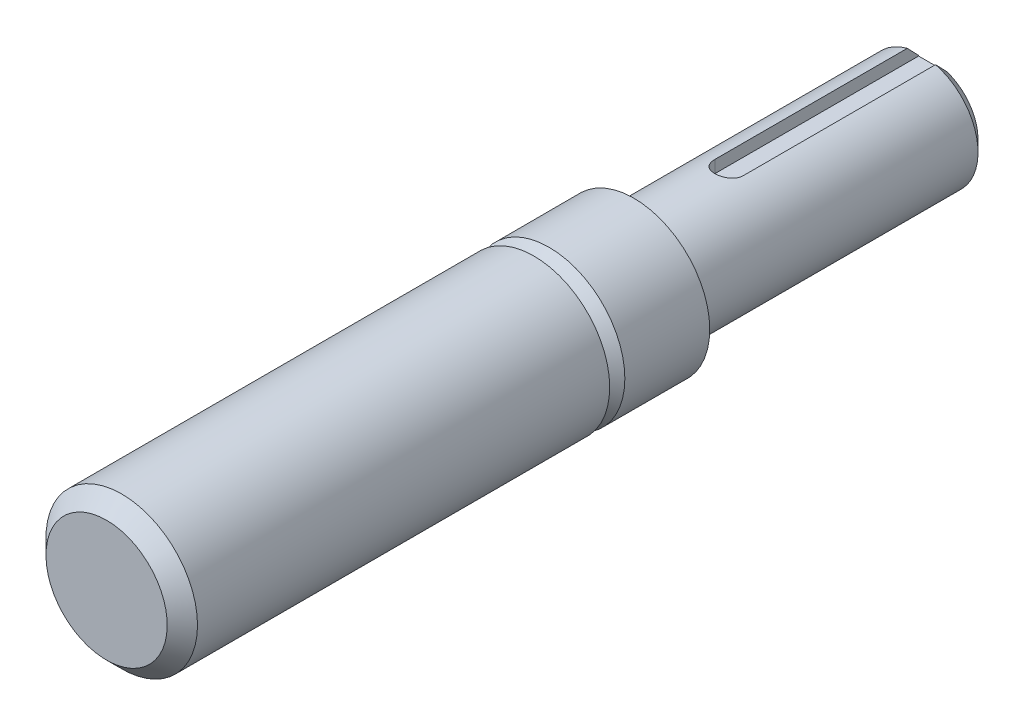
ISO-10303-21;
HEADER;
FILE_DESCRIPTION(('STEP AP214'),'2;1');
FILE_NAME('part.step','',(''),(''),'','','');
FILE_SCHEMA(('AUTOMOTIVE_DESIGN { 1 0 10303 214 1 1 1 1 }'));
ENDSEC;
DATA;
#1=APPLICATION_CONTEXT('core data for automotive mechanical design processes');
#2=APPLICATION_PROTOCOL_DEFINITION('international standard','automotive_design',2000,#1);
#3=PRODUCT_CONTEXT('',#1,'mechanical');
#4=PRODUCT('Part','Part','',(#3));
#5=PRODUCT_RELATED_PRODUCT_CATEGORY('part','',(#4));
#6=PRODUCT_DEFINITION_FORMATION('','',#4);
#7=PRODUCT_DEFINITION_CONTEXT('part definition',#1,'design');
#8=PRODUCT_DEFINITION('design','',#6,#7);
#9=PRODUCT_DEFINITION_SHAPE('','',#8);
#10=(LENGTH_UNIT() NAMED_UNIT(*) SI_UNIT(.MILLI.,.METRE.));
#11=(NAMED_UNIT(*) PLANE_ANGLE_UNIT() SI_UNIT($,.RADIAN.));
#12=(NAMED_UNIT(*) SI_UNIT($,.STERADIAN.) SOLID_ANGLE_UNIT());
#13=UNCERTAINTY_MEASURE_WITH_UNIT(LENGTH_MEASURE(1.E-05),#10,'distance_accuracy_value','');
#14=(GEOMETRIC_REPRESENTATION_CONTEXT(3) GLOBAL_UNCERTAINTY_ASSIGNED_CONTEXT((#13)) GLOBAL_UNIT_ASSIGNED_CONTEXT((#10,
#11,#12)) REPRESENTATION_CONTEXT('',''));
#15=CARTESIAN_POINT('',(0.,0.,0.));
#16=DIRECTION('',(0.,0.,1.));
#17=DIRECTION('',(1.,0.,0.));
#18=AXIS2_PLACEMENT_3D('',#15,#16,#17);
#19=CARTESIAN_POINT('',(0.,4.7625,-69.85));
#20=DIRECTION('',(0.,1.,0.));
#21=DIRECTION('',(0.,0.,1.));
#22=AXIS2_PLACEMENT_3D('',#19,#20,#21);
#23=PLANE('',#22);
#24=CARTESIAN_POINT('',(0.,4.7625,-69.85));
#25=DIRECTION('',(0.,1.,0.));
#26=DIRECTION('',(0.,0.,1.));
#27=AXIS2_PLACEMENT_3D('',#24,#25,#26);
#28=CIRCLE('',#27,1.58750000000001);
#29=CARTESIAN_POINT('',(-1.58750000000001,4.7625,-69.85));
#30=VERTEX_POINT('',#29);
#31=CARTESIAN_POINT('',(1.58750000000001,4.7625,-69.85));
#32=VERTEX_POINT('',#31);
#33=EDGE_CURVE('E74',#30,#32,#28,.T.);
#34=ORIENTED_EDGE('',*,*,#33,.T.);
#35=DIRECTION('',(0.,0.,-1.));
#36=VECTOR('',#35,1.);
#37=CARTESIAN_POINT('',(1.58750000000001,4.7625,-69.85));
#38=LINE('',#37,#36);
#39=CARTESIAN_POINT('',(1.5875,4.7625,-92.71));
#40=VERTEX_POINT('',#39);
#41=EDGE_CURVE('E70',#32,#40,#38,.T.);
#42=ORIENTED_EDGE('',*,*,#41,.T.);
#43=DIRECTION('',(1.,0.,0.));
#44=VECTOR('',#43,1.);
#45=CARTESIAN_POINT('',(0.,4.7625,-92.71));
#46=LINE('',#45,#44);
#47=CARTESIAN_POINT('',(-1.5875,4.7625,-92.71));
#48=VERTEX_POINT('',#47);
#49=EDGE_CURVE('E72',#40,#48,#46,.F.);
#50=ORIENTED_EDGE('',*,*,#49,.T.);
#51=DIRECTION('',(0.,0.,1.));
#52=VECTOR('',#51,1.);
#53=CARTESIAN_POINT('',(-1.5875,4.7625,-92.71));
#54=LINE('',#53,#52);
#55=EDGE_CURVE('E97',#48,#30,#54,.T.);
#56=ORIENTED_EDGE('',*,*,#55,.T.);
#57=EDGE_LOOP('',(#34,#42,#50,#56));
#58=FACE_BOUND('',#57,.T.);
#59=ADVANCED_FACE('F16',(#58),#23,.T.);
#60=CARTESIAN_POINT('',(0.,5.08,-92.71));
#61=DIRECTION('',(0.,0.,1.));
#62=DIRECTION('',(1.,0.,0.));
#63=AXIS2_PLACEMENT_3D('',#60,#61,#62);
#64=PLANE('',#63);
#65=DIRECTION('',(0.,1.,0.));
#66=VECTOR('',#65,1.);
#67=CARTESIAN_POINT('',(1.5875,4.7625,-92.71));
#68=LINE('',#67,#66);
#69=CARTESIAN_POINT('',(1.5875,4.82558221875647,-92.7099999999771));
#70=VERTEX_POINT('',#69);
#71=EDGE_CURVE('E79',#40,#70,#68,.T.);
#72=ORIENTED_EDGE('',*,*,#71,.T.);
#73=CARTESIAN_POINT('',(0.,0.,-92.7099999999541));
#74=DIRECTION('',(0.,0.,1.));
#75=DIRECTION('',(1.,0.,0.));
#76=AXIS2_PLACEMENT_3D('',#73,#74,#75);
#77=CIRCLE('',#76,5.08000000002085);
#78=CARTESIAN_POINT('',(-1.5875,4.82558221876673,-92.7099999999673));
#79=VERTEX_POINT('',#78);
#80=EDGE_CURVE('E64',#79,#70,#77,.T.);
#81=ORIENTED_EDGE('',*,*,#80,.F.);
#82=DIRECTION('',(0.,1.,0.));
#83=VECTOR('',#82,1.);
#84=CARTESIAN_POINT('',(-1.5875,4.7625,-92.71));
#85=LINE('',#84,#83);
#86=EDGE_CURVE('E85',#79,#48,#85,.F.);
#87=ORIENTED_EDGE('',*,*,#86,.T.);
#88=ORIENTED_EDGE('',*,*,#49,.F.);
#89=EDGE_LOOP('',(#72,#81,#87,#88));
#90=FACE_BOUND('',#89,.T.);
#91=ADVANCED_FACE('F82',(#90),#64,.F.);
#92=CARTESIAN_POINT('',(1.58750000000001,4.7625,-69.85));
#93=DIRECTION('',(1.,0.,0.));
#94=DIRECTION('',(0.,0.,-1.));
#95=AXIS2_PLACEMENT_3D('',#92,#93,#94);
#96=PLANE('',#95);
#97=ORIENTED_EDGE('',*,*,#71,.F.);
#98=ORIENTED_EDGE('',*,*,#41,.F.);
#99=DIRECTION('',(0.,1.,0.));
#100=VECTOR('',#99,1.);
#101=CARTESIAN_POINT('',(1.58750000000001,4.7625,-69.85));
#102=LINE('',#101,#100);
#103=CARTESIAN_POINT('',(1.58750000000001,6.14836106210427,-69.85));
#104=VERTEX_POINT('',#103);
#105=EDGE_CURVE('E91',#32,#104,#102,.T.);
#106=ORIENTED_EDGE('',*,*,#105,.T.);
#107=DIRECTION('',(0.,0.,1.));
#108=VECTOR('',#107,1.);
#109=CARTESIAN_POINT('',(1.5875,6.14836106210427,0.));
#110=LINE('',#109,#108);
#111=CARTESIAN_POINT('',(1.5875,6.14836106211221,-91.4400000000082));
#112=VERTEX_POINT('',#111);
#113=EDGE_CURVE('E130',#112,#104,#110,.T.);
#114=ORIENTED_EDGE('',*,*,#113,.F.);
#115=CARTESIAN_POINT('',(1.5875,4.82558221875283,-92.7099999999805));
#116=CARTESIAN_POINT('',(1.5875,4.93637443412473,-92.6047518791332));
#117=CARTESIAN_POINT('',(1.5875,5.04699444665306,-92.4993228179712));
#118=CARTESIAN_POINT('',(1.5875,5.26793948135338,-92.2881572289264));
#119=CARTESIAN_POINT('',(1.5875,5.37826450516857,-92.1824207027631));
#120=CARTESIAN_POINT('',(1.5875,5.59867002482966,-91.9706936027133));
#121=CARTESIAN_POINT('',(1.5875,5.70875052109395,-91.864703029262));
#122=CARTESIAN_POINT('',(1.5875,5.92870326414257,-91.6525047731704));
#123=CARTESIAN_POINT('',(1.5875,6.03857550976436,-91.5462970893249));
#124=CARTESIAN_POINT('',(1.5875,6.14836106212015,-91.4400000000164));
#125=B_SPLINE_CURVE_WITH_KNOTS('',3,(#115,#116,#117,#118,#119,#120,#121,#122,#123,#124),
.UNSPECIFIED.,.F.,.F.,(4,2,2,2,4),(0.,0.458441106288984,0.916879653578,1.37531741587532,
1.83375772987097),.UNSPECIFIED.);
#126=EDGE_CURVE('E19',#70,#112,#125,.T.);
#127=ORIENTED_EDGE('',*,*,#126,.F.);
#128=EDGE_LOOP('',(#97,#98,#106,#114,#127));
#129=FACE_BOUND('',#128,.T.);
#130=ADVANCED_FACE('F88',(#129),#96,.F.);
#131=CARTESIAN_POINT('',(0.,4.7625,-69.85));
#132=DIRECTION('',(0.,1.,0.));
#133=DIRECTION('',(0.,0.,1.));
#134=AXIS2_PLACEMENT_3D('',#131,#132,#133);
#135=CYLINDRICAL_SURFACE('',#134,1.58750000000001);
#136=ORIENTED_EDGE('',*,*,#33,.F.);
#137=DIRECTION('',(0.,1.,0.));
#138=VECTOR('',#137,1.);
#139=CARTESIAN_POINT('',(-1.58750000000001,4.7625,-69.85));
#140=LINE('',#139,#138);
#141=CARTESIAN_POINT('',(-1.58750000000001,6.14836106210427,-69.85));
#142=VERTEX_POINT('',#141);
#143=EDGE_CURVE('E39',#30,#142,#140,.T.);
#144=ORIENTED_EDGE('',*,*,#143,.T.);
#145=CARTESIAN_POINT('',(1.58750000000001,6.14836106210427,-69.85));
#146=CARTESIAN_POINT('',(1.58750053472211,6.14835810868573,-69.8060850480057));
#147=CARTESIAN_POINT('',(1.58567661174546,6.1488321571389,-69.7621918561208));
#148=CARTESIAN_POINT('',(1.57840569717736,6.15070373440419,-69.6747337400777));
#149=CARTESIAN_POINT('',(1.57295931521449,6.15210110782842,-69.6311687619314));
#150=CARTESIAN_POINT('',(1.55126572658893,6.1576221525004,-69.5016182301926));
#151=CARTESIAN_POINT('',(1.52966372960041,6.16307509376748,-69.4165229259281));
#152=CARTESIAN_POINT('',(1.47287895457943,6.17688995608206,-69.2513131201806));
#153=CARTESIAN_POINT('',(1.43769722409701,6.18525165274125,-69.1711982350581));
#154=CARTESIAN_POINT('',(1.35479517756303,6.20393662510198,-69.0179704752926));
#155=CARTESIAN_POINT('',(1.30707194181757,6.21426035741522,-68.9448592365312));
#156=CARTESIAN_POINT('',(1.1993371670561,6.23595707887749,-68.8061560652799));
#157=CARTESIAN_POINT('',(1.13910300733151,6.24734667388769,-68.740739700621));
#158=CARTESIAN_POINT('',(1.00851371119877,6.26975132963679,-68.6208062308858));
#159=CARTESIAN_POINT('',(0.938154957437516,6.28076625476574,-68.5662930380437));
#160=CARTESIAN_POINT('',(0.788089535804097,6.30136714833112,-68.4689918537532));
#161=CARTESIAN_POINT('',(0.708263180753401,6.31093033514495,-68.4263834043952));
#162=CARTESIAN_POINT('',(0.542357177260233,6.32734283789911,-68.3552996564682));
#163=CARTESIAN_POINT('',(0.456285166695509,6.33419540463604,-68.326807418165));
#164=CARTESIAN_POINT('',(0.308152380307604,6.34280690605921,-68.2914621393207));
#165=CARTESIAN_POINT('',(0.247067257356981,6.34549035539136,-68.2806200530494));
#166=CARTESIAN_POINT('',(0.123996454410069,6.3490876888745,-68.2661376914586));
#167=CARTESIAN_POINT('',(0.0620107875570678,6.35000159882553,-68.2624973111376));
#168=CARTESIAN_POINT('',(-0.0876803967488853,6.34999773933435,-68.2625038019276));
#169=CARTESIAN_POINT('',(-0.175411016460401,6.34816513335972,-68.269791067172));
#170=CARTESIAN_POINT('',(-0.348380525034884,6.34102879138944,-68.298712893547));
#171=CARTESIAN_POINT('',(-0.433616958406354,6.33572174751381,-68.3203611274699));
#172=CARTESIAN_POINT('',(-0.599040292949761,6.32222512421155,-68.3772658079356));
#173=CARTESIAN_POINT('',(-0.679233912558,6.31403948009637,-68.4125036825138));
#174=CARTESIAN_POINT('',(-0.832565934999752,6.29565763049594,-68.4955281549208));
#175=CARTESIAN_POINT('',(-0.905704517218842,6.28546147615119,-68.5433144335712));
#176=CARTESIAN_POINT('',(-1.04436365780362,6.26393038121454,-68.6511194237927));
#177=CARTESIAN_POINT('',(-1.10971829889381,6.25257786624039,-68.711348032021));
#178=CARTESIAN_POINT('',(-1.22951519838176,6.23012963849477,-68.8418842475642));
#179=CARTESIAN_POINT('',(-1.28395571935565,6.21903396685858,-68.9121934565639));
#180=CARTESIAN_POINT('',(-1.38116725538402,6.19817668389329,-69.062191767967));
#181=CARTESIAN_POINT('',(-1.42374920363039,6.18843780250449,-69.1420067176036));
#182=CARTESIAN_POINT('',(-1.4948050704593,6.17166094046036,-69.3079268970432));
#183=CARTESIAN_POINT('',(-1.52328958149325,6.16462093284003,-69.3940273480908));
#184=CARTESIAN_POINT('',(-1.55859647860437,6.15576956135877,-69.5421580322648));
#185=CARTESIAN_POINT('',(-1.56941841449223,6.15300921691421,-69.6032078119277));
#186=CARTESIAN_POINT('',(-1.58387467718143,6.14929718216966,-69.7261607465125));
#187=CARTESIAN_POINT('',(-1.58751418051884,6.14834418929122,-69.7880632544282));
#188=CARTESIAN_POINT('',(-1.58750000000001,6.14836106210427,-69.85));
#189=B_SPLINE_CURVE_WITH_KNOTS('',3,(#145,#146,#147,#148,#149,#150,#151,#152,#153,#154,#155,
#156,#157,#158,#159,#160,#161,#162,#163,#164,#165,#166,#167,#168,#169,#170,#171,#172,#173,#174,
#175,#176,#177,#178,#179,#180,#181,#182,#183,#184,#185,#186,#187,#188),.UNSPECIFIED.,.F.,.F.,(4,
2,2,2,2,2,2,2,2,2,2,2,2,2,2,2,2,2,2,2,2,4),(0.,0.131661631551332,0.263301111190635,
0.52582756580209,0.788333772987214,1.05090114649685,1.31861744482507,1.58642963242963,
1.85808613315678,2.12941584627082,2.31528840630712,2.50115825628454,2.7639696610674,
3.02703164315849,3.28973538447984,3.55243244437796,3.81998818241863,4.0875864790201,
4.3592344386457,4.63067797793265,4.81644389573718,5.00207587901889),.UNSPECIFIED.);
#190=EDGE_CURVE('E121',#104,#142,#189,.T.);
#191=ORIENTED_EDGE('',*,*,#190,.F.);
#192=ORIENTED_EDGE('',*,*,#105,.F.);
#193=EDGE_LOOP('',(#136,#144,#191,#192));
#194=FACE_BOUND('',#193,.T.);
#195=ADVANCED_FACE('F132',(#194),#135,.F.);
#196=CARTESIAN_POINT('',(-1.5875,4.7625,-92.71));
#197=DIRECTION('',(-1.,0.,0.));
#198=DIRECTION('',(0.,0.,1.));
#199=AXIS2_PLACEMENT_3D('',#196,#197,#198);
#200=PLANE('',#199);
#201=ORIENTED_EDGE('',*,*,#55,.F.);
#202=ORIENTED_EDGE('',*,*,#86,.F.);
#203=CARTESIAN_POINT('',(-1.5875,6.14836106212015,-91.4400000000164));
#204=CARTESIAN_POINT('',(-1.5875,6.03857550976436,-91.5462970893249));
#205=CARTESIAN_POINT('',(-1.5875,5.92870326414257,-91.6525047731704));
#206=CARTESIAN_POINT('',(-1.5875,5.70875052109395,-91.864703029262));
#207=CARTESIAN_POINT('',(-1.5875,5.59867002482966,-91.9706936027133));
#208=CARTESIAN_POINT('',(-1.5875,5.37826450516857,-92.1824207027631));
#209=CARTESIAN_POINT('',(-1.5875,5.26793948135339,-92.2881572289264));
#210=CARTESIAN_POINT('',(-1.5875,5.04699444665306,-92.4993228179712));
#211=CARTESIAN_POINT('',(-1.5875,4.93637443412474,-92.6047518791332));
#212=CARTESIAN_POINT('',(-1.5875,4.82558221875284,-92.7099999999805));
#213=B_SPLINE_CURVE_WITH_KNOTS('',3,(#203,#204,#205,#206,#207,#208,#209,#210,#211,#212),
.UNSPECIFIED.,.F.,.F.,(4,2,2,2,4),(0.,0.458440313995659,0.916878076292975,1.37531662358199,
1.83375772987097),.UNSPECIFIED.);
#214=CARTESIAN_POINT('',(-1.58750000000001,6.14836106211221,-91.4400000000082));
#215=VERTEX_POINT('',#214);
#216=EDGE_CURVE('E148',#215,#79,#213,.T.);
#217=ORIENTED_EDGE('',*,*,#216,.F.);
#218=DIRECTION('',(0.,0.,1.));
#219=VECTOR('',#218,1.);
#220=CARTESIAN_POINT('',(-1.58750000000001,6.14836106210427,0.));
#221=LINE('',#220,#219);
#222=EDGE_CURVE('E129',#142,#215,#221,.F.);
#223=ORIENTED_EDGE('',*,*,#222,.F.);
#224=ORIENTED_EDGE('',*,*,#143,.F.);
#225=EDGE_LOOP('',(#201,#202,#217,#223,#224));
#226=FACE_BOUND('',#225,.T.);
#227=ADVANCED_FACE('F145',(#226),#200,.F.);
#228=CARTESIAN_POINT('',(0.,0.,-91.4400000000342));
#229=DIRECTION('',(0.,0.,1.));
#230=DIRECTION('',(1.,0.,0.));
#231=AXIS2_PLACEMENT_3D('',#228,#229,#230);
#232=CONICAL_SURFACE('',#231,6.34999999999764,0.785398163419828);
#233=ORIENTED_EDGE('',*,*,#80,.T.);
#234=ORIENTED_EDGE('',*,*,#126,.T.);
#235=CARTESIAN_POINT('',(0.,0.,-91.44));
#236=DIRECTION('',(0.,0.,1.));
#237=DIRECTION('',(1.,0.,0.));
#238=AXIS2_PLACEMENT_3D('',#235,#236,#237);
#239=CIRCLE('',#238,6.35);
#240=EDGE_CURVE('E155',#215,#112,#239,.T.);
#241=ORIENTED_EDGE('',*,*,#240,.F.);
#242=ORIENTED_EDGE('',*,*,#216,.T.);
#243=EDGE_LOOP('',(#233,#234,#241,#242));
#244=FACE_BOUND('',#243,.T.);
#245=ADVANCED_FACE('F140',(#244),#232,.T.);
#246=CARTESIAN_POINT('',(0.,0.,0.));
#247=DIRECTION('',(0.,0.,1.));
#248=DIRECTION('',(1.,0.,0.));
#249=AXIS2_PLACEMENT_3D('',#246,#247,#248);
#250=CYLINDRICAL_SURFACE('',#249,6.35);
#251=ORIENTED_EDGE('',*,*,#222,.T.);
#252=ORIENTED_EDGE('',*,*,#240,.T.);
#253=ORIENTED_EDGE('',*,*,#113,.T.);
#254=ORIENTED_EDGE('',*,*,#190,.T.);
#255=EDGE_LOOP('',(#251,#252,#253,#254));
#256=FACE_BOUND('',#255,.T.);
#257=CARTESIAN_POINT('',(0.,0.,-60.451999999998));
#258=DIRECTION('',(0.,0.,-1.));
#259=DIRECTION('',(-1.,0.,0.));
#260=AXIS2_PLACEMENT_3D('',#257,#258,#259);
#261=CIRCLE('',#260,6.35000000002606);
#262=CARTESIAN_POINT('',(-6.35000000002606,0.,-60.451999999998));
#263=VERTEX_POINT('',#262);
#264=EDGE_CURVE('E120',#263,#263,#261,.F.);
#265=ORIENTED_EDGE('',*,*,#264,.F.);
#266=EDGE_LOOP('',(#265));
#267=FACE_BOUND('',#266,.T.);
#268=ADVANCED_FACE('F135',(#256,#267),#250,.T.);
#269=CARTESIAN_POINT('',(0.,0.,-60.451999999998));
#270=DIRECTION('',(0.,0.,-1.));
#271=DIRECTION('',(-1.,0.,0.));
#272=AXIS2_PLACEMENT_3D('',#269,#270,#271);
#273=CONICAL_SURFACE('',#272,6.35000000002606,0.463647609000806);
#274=CARTESIAN_POINT('',(0.,0.,-59.1820000000212));
#275=DIRECTION('',(0.,0.,-1.));
#276=DIRECTION('',(-1.,0.,0.));
#277=AXIS2_PLACEMENT_3D('',#274,#275,#276);
#278=CIRCLE('',#277,5.71500000003766);
#279=CARTESIAN_POINT('',(-5.71500000003766,0.,-59.1820000000212));
#280=VERTEX_POINT('',#279);
#281=EDGE_CURVE('E117',#280,#280,#278,.T.);
#282=ORIENTED_EDGE('',*,*,#281,.T.);
#283=EDGE_LOOP('',(#282));
#284=FACE_BOUND('',#283,.T.);
#285=ORIENTED_EDGE('',*,*,#264,.T.);
#286=EDGE_LOOP('',(#285));
#287=FACE_BOUND('',#286,.T.);
#288=ADVANCED_FACE('F139',(#284,#287),#273,.T.);
#289=CARTESIAN_POINT('',(0.,8.50265,-59.182));
#290=DIRECTION('',(0.,0.,1.));
#291=DIRECTION('',(1.,0.,0.));
#292=AXIS2_PLACEMENT_3D('',#289,#290,#291);
#293=PLANE('',#292);
#294=ORIENTED_EDGE('',*,*,#281,.F.);
#295=EDGE_LOOP('',(#294));
#296=FACE_BOUND('',#295,.T.);
#297=CARTESIAN_POINT('',(0.,0.,-59.182));
#298=DIRECTION('',(0.,0.,1.));
#299=DIRECTION('',(1.,0.,0.));
#300=AXIS2_PLACEMENT_3D('',#297,#298,#299);
#301=CIRCLE('',#300,8.50265);
#302=CARTESIAN_POINT('',(8.50265,0.,-59.182));
#303=VERTEX_POINT('',#302);
#304=EDGE_CURVE('E114',#303,#303,#301,.T.);
#305=ORIENTED_EDGE('',*,*,#304,.F.);
#306=EDGE_LOOP('',(#305));
#307=FACE_BOUND('',#306,.T.);
#308=ADVANCED_FACE('F200',(#296,#307),#293,.F.);
#309=CARTESIAN_POINT('',(0.,0.,0.));
#310=DIRECTION('',(0.,0.,1.));
#311=DIRECTION('',(1.,0.,0.));
#312=AXIS2_PLACEMENT_3D('',#309,#310,#311);
#313=CYLINDRICAL_SURFACE('',#312,8.50265);
#314=ORIENTED_EDGE('',*,*,#304,.T.);
#315=EDGE_LOOP('',(#314));
#316=FACE_BOUND('',#315,.T.);
#317=CARTESIAN_POINT('',(0.,0.,-49.65573));
#318=DIRECTION('',(0.,0.,-1.));
#319=DIRECTION('',(-1.,0.,0.));
#320=AXIS2_PLACEMENT_3D('',#317,#318,#319);
#321=CIRCLE('',#320,8.50265);
#322=CARTESIAN_POINT('',(-8.50265,0.,-49.65573));
#323=VERTEX_POINT('',#322);
#324=EDGE_CURVE('E113',#323,#323,#321,.F.);
#325=ORIENTED_EDGE('',*,*,#324,.F.);
#326=EDGE_LOOP('',(#325));
#327=FACE_BOUND('',#326,.T.);
#328=ADVANCED_FACE('F197',(#316,#327),#313,.T.);
#329=CARTESIAN_POINT('',(0.,0.,-49.65573));
#330=DIRECTION('',(0.,0.,-1.));
#331=DIRECTION('',(0.,1.,0.));
#332=AXIS2_PLACEMENT_3D('',#329,#330,#331);
#333=CONICAL_SURFACE('',#332,8.50265,0.785398163397449);
#334=CARTESIAN_POINT('',(0.,0.,-47.9552));
#335=DIRECTION('',(0.,0.,-1.));
#336=DIRECTION('',(0.,1.,0.));
#337=AXIS2_PLACEMENT_3D('',#334,#335,#336);
#338=CIRCLE('',#337,6.80212);
#339=CARTESIAN_POINT('',(0.,6.80212,-47.9552));
#340=VERTEX_POINT('',#339);
#341=EDGE_CURVE('E110',#340,#340,#338,.T.);
#342=ORIENTED_EDGE('',*,*,#341,.T.);
#343=EDGE_LOOP('',(#342));
#344=FACE_BOUND('',#343,.T.);
#345=ORIENTED_EDGE('',*,*,#324,.T.);
#346=EDGE_LOOP('',(#345));
#347=FACE_BOUND('',#346,.T.);
#348=ADVANCED_FACE('F193',(#344,#347),#333,.T.);
#349=CARTESIAN_POINT('',(0.,0.,0.));
#350=DIRECTION('',(0.,0.,-1.));
#351=DIRECTION('',(-1.,0.,0.));
#352=AXIS2_PLACEMENT_3D('',#349,#350,#351);
#353=PLANE('',#352);
#354=CARTESIAN_POINT('',(0.,0.,0.));
#355=DIRECTION('',(0.,0.,-1.));
#356=DIRECTION('',(0.,1.,0.));
#357=AXIS2_PLACEMENT_3D('',#354,#355,#356);
#358=CIRCLE('',#357,6.80212);
#359=CARTESIAN_POINT('',(0.,6.80212,0.));
#360=VERTEX_POINT('',#359);
#361=EDGE_CURVE('E107',#360,#360,#358,.T.);
#362=ORIENTED_EDGE('',*,*,#361,.F.);
#363=EDGE_LOOP('',(#362));
#364=FACE_BOUND('',#363,.T.);
#365=ADVANCED_FACE('F189',(#364),#353,.F.);
#366=CARTESIAN_POINT('',(0.,8.50265,-47.9552));
#367=DIRECTION('',(0.,0.,1.));
#368=DIRECTION('',(1.,0.,0.));
#369=AXIS2_PLACEMENT_3D('',#366,#367,#368);
#370=PLANE('',#369);
#371=ORIENTED_EDGE('',*,*,#341,.F.);
#372=EDGE_LOOP('',(#371));
#373=FACE_BOUND('',#372,.T.);
#374=CARTESIAN_POINT('',(0.,0.,-47.9552));
#375=DIRECTION('',(0.,0.,1.));
#376=DIRECTION('',(1.,0.,0.));
#377=AXIS2_PLACEMENT_3D('',#374,#375,#376);
#378=CIRCLE('',#377,8.50265);
#379=CARTESIAN_POINT('',(8.50265,0.,-47.9552));
#380=VERTEX_POINT('',#379);
#381=EDGE_CURVE('E30',#380,#380,#378,.T.);
#382=ORIENTED_EDGE('',*,*,#381,.F.);
#383=EDGE_LOOP('',(#382));
#384=FACE_BOUND('',#383,.T.);
#385=ADVANCED_FACE('F182',(#373,#384),#370,.F.);
#386=CARTESIAN_POINT('',(0.,0.,-1.70053));
#387=DIRECTION('',(0.,0.,-1.));
#388=DIRECTION('',(0.,1.,0.));
#389=AXIS2_PLACEMENT_3D('',#386,#387,#388);
#390=CONICAL_SURFACE('',#389,8.50265,0.785398163397448);
#391=CARTESIAN_POINT('',(0.,0.,-1.70053));
#392=DIRECTION('',(0.,0.,1.));
#393=DIRECTION('',(1.,0.,0.));
#394=AXIS2_PLACEMENT_3D('',#391,#392,#393);
#395=CIRCLE('',#394,8.50265);
#396=CARTESIAN_POINT('',(8.50265,0.,-1.70053));
#397=VERTEX_POINT('',#396);
#398=EDGE_CURVE('E11',#397,#397,#395,.F.);
#399=ORIENTED_EDGE('',*,*,#398,.F.);
#400=EDGE_LOOP('',(#399));
#401=FACE_BOUND('',#400,.T.);
#402=ORIENTED_EDGE('',*,*,#361,.T.);
#403=EDGE_LOOP('',(#402));
#404=FACE_BOUND('',#403,.T.);
#405=ADVANCED_FACE('F176',(#401,#404),#390,.T.);
#406=CARTESIAN_POINT('',(0.,0.,0.));
#407=DIRECTION('',(0.,0.,1.));
#408=DIRECTION('',(1.,0.,0.));
#409=AXIS2_PLACEMENT_3D('',#406,#407,#408);
#410=CYLINDRICAL_SURFACE('',#409,8.50265);
#411=ORIENTED_EDGE('',*,*,#398,.T.);
#412=EDGE_LOOP('',(#411));
#413=FACE_BOUND('',#412,.T.);
#414=ORIENTED_EDGE('',*,*,#381,.T.);
#415=EDGE_LOOP('',(#414));
#416=FACE_BOUND('',#415,.T.);
#417=ADVANCED_FACE('F174',(#413,#416),#410,.T.);
#418=CLOSED_SHELL('',(#59,#91,#130,#195,#227,#245,#268,#288,#308,#328,#348,#365,#385,#405,#417));
#419=MANIFOLD_SOLID_BREP('B1',#418);
#420=ADVANCED_BREP_SHAPE_REPRESENTATION('',(#18,#419),#14);
#421=SHAPE_DEFINITION_REPRESENTATION(#9,#420);
ENDSEC;
END-ISO-10303-21;
